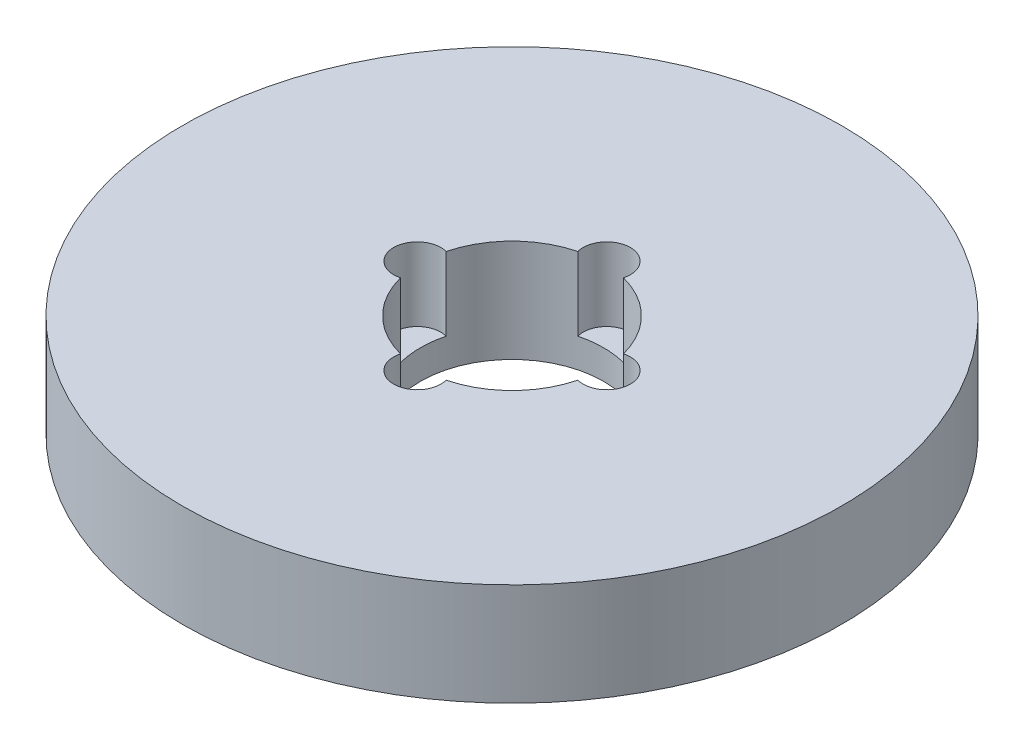
ISO-10303-21;
HEADER;
FILE_DESCRIPTION(('STEP AP214'),'2;1');
FILE_NAME('part.step','',(''),(''),'','','');
FILE_SCHEMA(('AUTOMOTIVE_DESIGN { 1 0 10303 214 1 1 1 1 }'));
ENDSEC;
DATA;
#1=APPLICATION_CONTEXT('core data for automotive mechanical design processes');
#2=APPLICATION_PROTOCOL_DEFINITION('international standard','automotive_design',2000,#1);
#3=PRODUCT_CONTEXT('',#1,'mechanical');
#4=PRODUCT('Part','Part','',(#3));
#5=PRODUCT_RELATED_PRODUCT_CATEGORY('part','',(#4));
#6=PRODUCT_DEFINITION_FORMATION('','',#4);
#7=PRODUCT_DEFINITION_CONTEXT('part definition',#1,'design');
#8=PRODUCT_DEFINITION('design','',#6,#7);
#9=PRODUCT_DEFINITION_SHAPE('','',#8);
#10=(LENGTH_UNIT() NAMED_UNIT(*) SI_UNIT(.MILLI.,.METRE.));
#11=(NAMED_UNIT(*) PLANE_ANGLE_UNIT() SI_UNIT($,.RADIAN.));
#12=(NAMED_UNIT(*) SI_UNIT($,.STERADIAN.) SOLID_ANGLE_UNIT());
#13=UNCERTAINTY_MEASURE_WITH_UNIT(LENGTH_MEASURE(1.E-05),#10,'distance_accuracy_value','');
#14=(GEOMETRIC_REPRESENTATION_CONTEXT(3) GLOBAL_UNCERTAINTY_ASSIGNED_CONTEXT((#13)) GLOBAL_UNIT_ASSIGNED_CONTEXT((#10,
#11,#12)) REPRESENTATION_CONTEXT('',''));
#15=CARTESIAN_POINT('',(0.,0.,0.));
#16=DIRECTION('',(0.,0.,1.));
#17=DIRECTION('',(1.,0.,0.));
#18=AXIS2_PLACEMENT_3D('',#15,#16,#17);
#19=CARTESIAN_POINT('',(0.,14.,0.));
#20=DIRECTION('',(0.,-1.,0.));
#21=DIRECTION('',(0.,0.,-1.));
#22=AXIS2_PLACEMENT_3D('',#19,#20,#21);
#23=CYLINDRICAL_SURFACE('',#22,45.);
#24=CARTESIAN_POINT('',(0.,14.,0.));
#25=DIRECTION('',(0.,1.,0.));
#26=DIRECTION('',(0.,0.,1.));
#27=AXIS2_PLACEMENT_3D('',#24,#25,#26);
#28=CIRCLE('',#27,45.);
#29=CARTESIAN_POINT('',(0.,14.,45.));
#30=VERTEX_POINT('',#29);
#31=EDGE_CURVE('E145',#30,#30,#28,.T.);
#32=ORIENTED_EDGE('',*,*,#31,.F.);
#33=EDGE_LOOP('',(#32));
#34=FACE_BOUND('',#33,.T.);
#35=CARTESIAN_POINT('',(0.,0.,0.));
#36=DIRECTION('',(0.,1.,0.));
#37=DIRECTION('',(0.,0.,1.));
#38=AXIS2_PLACEMENT_3D('',#35,#36,#37);
#39=CIRCLE('',#38,45.);
#40=CARTESIAN_POINT('',(0.,0.,45.));
#41=VERTEX_POINT('',#40);
#42=EDGE_CURVE('E143',#41,#41,#39,.T.);
#43=ORIENTED_EDGE('',*,*,#42,.T.);
#44=EDGE_LOOP('',(#43));
#45=FACE_BOUND('',#44,.T.);
#46=ADVANCED_FACE('F39',(#34,#45),#23,.T.);
#47=CARTESIAN_POINT('',(0.,14.,0.));
#48=DIRECTION('',(0.,1.,0.));
#49=DIRECTION('',(0.,0.,1.));
#50=AXIS2_PLACEMENT_3D('',#47,#48,#49);
#51=PLANE('',#50);
#52=CARTESIAN_POINT('',(0.,14.,12.9368694405795));
#53=DIRECTION('',(0.,1.,0.));
#54=DIRECTION('',(1.,0.,0.));
#55=AXIS2_PLACEMENT_3D('',#52,#53,#54);
#56=CIRCLE('',#55,3.22331690164593);
#57=CARTESIAN_POINT('',(-3.11434234712611,14.,12.1058197469191));
#58=VERTEX_POINT('',#57);
#59=CARTESIAN_POINT('',(3.11434234712619,14.,12.1058197469191));
#60=VERTEX_POINT('',#59);
#61=EDGE_CURVE('E152',#58,#60,#56,.T.);
#62=ORIENTED_EDGE('',*,*,#61,.F.);
#63=CARTESIAN_POINT('',(0.,14.,0.));
#64=DIRECTION('',(0.,1.,0.));
#65=DIRECTION('',(0.,0.,1.));
#66=AXIS2_PLACEMENT_3D('',#63,#64,#65);
#67=CIRCLE('',#66,12.5);
#68=CARTESIAN_POINT('',(-12.1058197469191,14.,3.11434234712615));
#69=VERTEX_POINT('',#68);
#70=EDGE_CURVE('E133',#69,#58,#67,.T.);
#71=ORIENTED_EDGE('',*,*,#70,.F.);
#72=CARTESIAN_POINT('',(-12.9368694405795,14.,0.));
#73=DIRECTION('',(0.,1.,0.));
#74=DIRECTION('',(0.,0.,1.));
#75=AXIS2_PLACEMENT_3D('',#72,#73,#74);
#76=CIRCLE('',#75,3.22331690164593);
#77=CARTESIAN_POINT('',(-12.1058197469191,14.,-3.11434234712615));
#78=VERTEX_POINT('',#77);
#79=EDGE_CURVE('E128',#78,#69,#76,.T.);
#80=ORIENTED_EDGE('',*,*,#79,.F.);
#81=CARTESIAN_POINT('',(-3.11434234712627,14.,-12.1058197469191));
#82=VERTEX_POINT('',#81);
#83=EDGE_CURVE('E121',#82,#78,#67,.T.);
#84=ORIENTED_EDGE('',*,*,#83,.F.);
#85=CARTESIAN_POINT('',(-1.355065147045E-13,14.,-12.9368694405795));
#86=DIRECTION('',(0.,1.,0.));
#87=DIRECTION('',(-1.,0.,0.));
#88=AXIS2_PLACEMENT_3D('',#85,#86,#87);
#89=CIRCLE('',#88,3.22331690164593);
#90=CARTESIAN_POINT('',(3.11434234712602,14.,-12.1058197469192));
#91=VERTEX_POINT('',#90);
#92=EDGE_CURVE('E105',#91,#82,#89,.T.);
#93=ORIENTED_EDGE('',*,*,#92,.F.);
#94=CARTESIAN_POINT('',(12.1058197469191,14.,-3.11434234712615));
#95=VERTEX_POINT('',#94);
#96=EDGE_CURVE('E131',#95,#91,#67,.T.);
#97=ORIENTED_EDGE('',*,*,#96,.F.);
#98=CARTESIAN_POINT('',(12.9368694405795,14.,0.));
#99=DIRECTION('',(0.,1.,0.));
#100=DIRECTION('',(0.,0.,-1.));
#101=AXIS2_PLACEMENT_3D('',#98,#99,#100);
#102=CIRCLE('',#101,3.22331690164593);
#103=CARTESIAN_POINT('',(12.1058197469191,14.,3.11434234712615));
#104=VERTEX_POINT('',#103);
#105=EDGE_CURVE('E154',#104,#95,#102,.T.);
#106=ORIENTED_EDGE('',*,*,#105,.F.);
#107=EDGE_CURVE('E134',#60,#104,#67,.T.);
#108=ORIENTED_EDGE('',*,*,#107,.F.);
#109=EDGE_LOOP('',(#62,#71,#80,#84,#93,#97,#106,#108));
#110=FACE_BOUND('',#109,.T.);
#111=ORIENTED_EDGE('',*,*,#31,.T.);
#112=EDGE_LOOP('',(#111));
#113=FACE_BOUND('',#112,.T.);
#114=ADVANCED_FACE('F130',(#110,#113),#51,.T.);
#115=CARTESIAN_POINT('',(0.,0.,0.));
#116=DIRECTION('',(0.,1.,0.));
#117=DIRECTION('',(0.,0.,1.));
#118=AXIS2_PLACEMENT_3D('',#115,#116,#117);
#119=PLANE('',#118);
#120=CARTESIAN_POINT('',(0.,0.,0.));
#121=DIRECTION('',(0.,1.,0.));
#122=DIRECTION('',(0.,0.,1.));
#123=AXIS2_PLACEMENT_3D('',#120,#121,#122);
#124=CIRCLE('',#123,12.5);
#125=CARTESIAN_POINT('',(0.,0.,12.5));
#126=VERTEX_POINT('',#125);
#127=EDGE_CURVE('E135',#126,#126,#124,.T.);
#128=ORIENTED_EDGE('',*,*,#127,.T.);
#129=EDGE_LOOP('',(#128));
#130=FACE_BOUND('',#129,.T.);
#131=ORIENTED_EDGE('',*,*,#42,.F.);
#132=EDGE_LOOP('',(#131));
#133=FACE_BOUND('',#132,.T.);
#134=ADVANCED_FACE('F195',(#130,#133),#119,.F.);
#135=CARTESIAN_POINT('',(0.,14.,0.));
#136=DIRECTION('',(0.,-1.,0.));
#137=DIRECTION('',(0.,0.,-1.));
#138=AXIS2_PLACEMENT_3D('',#135,#136,#137);
#139=CYLINDRICAL_SURFACE('',#138,12.5);
#140=DIRECTION('',(0.,1.,0.));
#141=VECTOR('',#140,1.);
#142=CARTESIAN_POINT('',(-3.11434234712611,8.99186282411448,12.1058197469191));
#143=LINE('',#142,#141);
#144=CARTESIAN_POINT('',(-3.11434234712611,3.98372564822896,12.1058197469191));
#145=VERTEX_POINT('',#144);
#146=EDGE_CURVE('E11',#145,#58,#143,.T.);
#147=ORIENTED_EDGE('',*,*,#146,.F.);
#148=CARTESIAN_POINT('',(0.,3.98372564822896,0.));
#149=DIRECTION('',(0.,1.,0.));
#150=DIRECTION('',(0.,0.,1.));
#151=AXIS2_PLACEMENT_3D('',#148,#149,#150);
#152=CIRCLE('',#151,12.5);
#153=CARTESIAN_POINT('',(3.11434234712619,3.98372564822896,12.1058197469191));
#154=VERTEX_POINT('',#153);
#155=EDGE_CURVE('E169',#145,#154,#152,.T.);
#156=ORIENTED_EDGE('',*,*,#155,.T.);
#157=DIRECTION('',(0.,1.,0.));
#158=VECTOR('',#157,1.);
#159=CARTESIAN_POINT('',(3.11434234712619,8.99186282411448,12.1058197469191));
#160=LINE('',#159,#158);
#161=EDGE_CURVE('E46',#60,#154,#160,.F.);
#162=ORIENTED_EDGE('',*,*,#161,.F.);
#163=ORIENTED_EDGE('',*,*,#107,.T.);
#164=DIRECTION('',(0.,1.,0.));
#165=VECTOR('',#164,1.);
#166=CARTESIAN_POINT('',(12.1058197469191,8.99186282411448,3.11434234712615));
#167=LINE('',#166,#165);
#168=CARTESIAN_POINT('',(12.1058197469191,3.98372564822896,3.11434234712615));
#169=VERTEX_POINT('',#168);
#170=EDGE_CURVE('E151',#169,#104,#167,.T.);
#171=ORIENTED_EDGE('',*,*,#170,.F.);
#172=CARTESIAN_POINT('',(0.,3.98372564822896,0.));
#173=DIRECTION('',(0.,1.,0.));
#174=DIRECTION('',(0.,0.,1.));
#175=AXIS2_PLACEMENT_3D('',#172,#173,#174);
#176=CIRCLE('',#175,12.5);
#177=CARTESIAN_POINT('',(12.1058197469191,3.98372564822896,-3.11434234712615));
#178=VERTEX_POINT('',#177);
#179=EDGE_CURVE('E173',#169,#178,#176,.T.);
#180=ORIENTED_EDGE('',*,*,#179,.T.);
#181=DIRECTION('',(0.,1.,0.));
#182=VECTOR('',#181,1.);
#183=CARTESIAN_POINT('',(12.1058197469191,8.99186282411448,-3.11434234712615));
#184=LINE('',#183,#182);
#185=EDGE_CURVE('E168',#95,#178,#184,.F.);
#186=ORIENTED_EDGE('',*,*,#185,.F.);
#187=ORIENTED_EDGE('',*,*,#96,.T.);
#188=DIRECTION('',(0.,1.,0.));
#189=VECTOR('',#188,1.);
#190=CARTESIAN_POINT('',(3.11434234712602,8.99186282411448,-12.1058197469191));
#191=LINE('',#190,#189);
#192=CARTESIAN_POINT('',(3.11434234712602,3.98372564822896,-12.1058197469192));
#193=VERTEX_POINT('',#192);
#194=EDGE_CURVE('E108',#193,#91,#191,.T.);
#195=ORIENTED_EDGE('',*,*,#194,.F.);
#196=CARTESIAN_POINT('',(0.,3.98372564822896,0.));
#197=DIRECTION('',(0.,1.,0.));
#198=DIRECTION('',(0.,0.,1.));
#199=AXIS2_PLACEMENT_3D('',#196,#197,#198);
#200=CIRCLE('',#199,12.5);
#201=CARTESIAN_POINT('',(-3.11434234712627,3.98372564822896,-12.1058197469191));
#202=VERTEX_POINT('',#201);
#203=EDGE_CURVE('E122',#193,#202,#200,.T.);
#204=ORIENTED_EDGE('',*,*,#203,.T.);
#205=DIRECTION('',(0.,1.,0.));
#206=VECTOR('',#205,1.);
#207=CARTESIAN_POINT('',(-3.11434234712627,8.99186282411448,-12.1058197469191));
#208=LINE('',#207,#206);
#209=EDGE_CURVE('E106',#82,#202,#208,.F.);
#210=ORIENTED_EDGE('',*,*,#209,.F.);
#211=ORIENTED_EDGE('',*,*,#83,.T.);
#212=DIRECTION('',(0.,1.,0.));
#213=VECTOR('',#212,1.);
#214=CARTESIAN_POINT('',(-12.1058197469191,8.99186282411448,-3.11434234712615));
#215=LINE('',#214,#213);
#216=CARTESIAN_POINT('',(-12.1058197469191,3.98372564822896,-3.11434234712615));
#217=VERTEX_POINT('',#216);
#218=EDGE_CURVE('E177',#217,#78,#215,.T.);
#219=ORIENTED_EDGE('',*,*,#218,.F.);
#220=CARTESIAN_POINT('',(0.,3.98372564822896,0.));
#221=DIRECTION('',(0.,1.,0.));
#222=DIRECTION('',(0.,0.,1.));
#223=AXIS2_PLACEMENT_3D('',#220,#221,#222);
#224=CIRCLE('',#223,12.5);
#225=CARTESIAN_POINT('',(-12.1058197469191,3.98372564822896,3.11434234712615));
#226=VERTEX_POINT('',#225);
#227=EDGE_CURVE('E185',#217,#226,#224,.T.);
#228=ORIENTED_EDGE('',*,*,#227,.T.);
#229=DIRECTION('',(0.,1.,0.));
#230=VECTOR('',#229,1.);
#231=CARTESIAN_POINT('',(-12.1058197469191,8.99186282411448,3.11434234712615));
#232=LINE('',#231,#230);
#233=EDGE_CURVE('E179',#69,#226,#232,.F.);
#234=ORIENTED_EDGE('',*,*,#233,.F.);
#235=ORIENTED_EDGE('',*,*,#70,.T.);
#236=EDGE_LOOP('',(#147,#156,#162,#163,#171,#180,#186,#187,#195,#204,#210,#211,#219,#228,#234,#235));
#237=FACE_BOUND('',#236,.T.);
#238=ORIENTED_EDGE('',*,*,#127,.F.);
#239=EDGE_LOOP('',(#238));
#240=FACE_BOUND('',#239,.T.);
#241=ADVANCED_FACE('F117',(#237,#240),#139,.F.);
#242=CARTESIAN_POINT('',(-12.9368694405795,3.98372564822896,0.));
#243=DIRECTION('',(0.,1.,0.));
#244=DIRECTION('',(0.,0.,1.));
#245=AXIS2_PLACEMENT_3D('',#242,#243,#244);
#246=CYLINDRICAL_SURFACE('',#245,3.22331690164593);
#247=ORIENTED_EDGE('',*,*,#218,.T.);
#248=ORIENTED_EDGE('',*,*,#79,.T.);
#249=ORIENTED_EDGE('',*,*,#233,.T.);
#250=CARTESIAN_POINT('',(-12.9368694405795,3.98372564822896,0.));
#251=DIRECTION('',(0.,1.,0.));
#252=DIRECTION('',(0.,0.,1.));
#253=AXIS2_PLACEMENT_3D('',#250,#251,#252);
#254=CIRCLE('',#253,3.22331690164593);
#255=EDGE_CURVE('E140',#217,#226,#254,.T.);
#256=ORIENTED_EDGE('',*,*,#255,.F.);
#257=EDGE_LOOP('',(#247,#248,#249,#256));
#258=FACE_BOUND('',#257,.T.);
#259=ADVANCED_FACE('F200',(#258),#246,.F.);
#260=CARTESIAN_POINT('',(-12.9368694405795,3.98372564822896,0.));
#261=DIRECTION('',(0.,1.,0.));
#262=DIRECTION('',(0.,0.,1.));
#263=AXIS2_PLACEMENT_3D('',#260,#261,#262);
#264=PLANE('',#263);
#265=ORIENTED_EDGE('',*,*,#255,.T.);
#266=ORIENTED_EDGE('',*,*,#227,.F.);
#267=EDGE_LOOP('',(#265,#266));
#268=FACE_BOUND('',#267,.T.);
#269=ADVANCED_FACE('F202',(#268),#264,.T.);
#270=CARTESIAN_POINT('',(-1.355065147045E-13,3.98372564822896,-12.9368694405795));
#271=DIRECTION('',(0.,1.,0.));
#272=DIRECTION('',(0.,0.,1.));
#273=AXIS2_PLACEMENT_3D('',#270,#271,#272);
#274=CYLINDRICAL_SURFACE('',#273,3.22331690164593);
#275=ORIENTED_EDGE('',*,*,#194,.T.);
#276=ORIENTED_EDGE('',*,*,#92,.T.);
#277=ORIENTED_EDGE('',*,*,#209,.T.);
#278=CARTESIAN_POINT('',(-1.355065147045E-13,3.98372564822896,-12.9368694405795));
#279=DIRECTION('',(0.,1.,0.));
#280=DIRECTION('',(-1.,0.,0.));
#281=AXIS2_PLACEMENT_3D('',#278,#279,#280);
#282=CIRCLE('',#281,3.22331690164593);
#283=EDGE_CURVE('E111',#193,#202,#282,.T.);
#284=ORIENTED_EDGE('',*,*,#283,.F.);
#285=EDGE_LOOP('',(#275,#276,#277,#284));
#286=FACE_BOUND('',#285,.T.);
#287=ADVANCED_FACE('F102',(#286),#274,.F.);
#288=CARTESIAN_POINT('',(-1.355065147045E-13,3.98372564822896,-12.9368694405795));
#289=DIRECTION('',(0.,1.,0.));
#290=DIRECTION('',(-1.,0.,0.));
#291=AXIS2_PLACEMENT_3D('',#288,#289,#290);
#292=PLANE('',#291);
#293=ORIENTED_EDGE('',*,*,#283,.T.);
#294=ORIENTED_EDGE('',*,*,#203,.F.);
#295=EDGE_LOOP('',(#293,#294));
#296=FACE_BOUND('',#295,.T.);
#297=ADVANCED_FACE('F211',(#296),#292,.T.);
#298=CARTESIAN_POINT('',(12.9368694405795,3.98372564822896,0.));
#299=DIRECTION('',(0.,1.,0.));
#300=DIRECTION('',(0.,0.,1.));
#301=AXIS2_PLACEMENT_3D('',#298,#299,#300);
#302=CYLINDRICAL_SURFACE('',#301,3.22331690164593);
#303=ORIENTED_EDGE('',*,*,#170,.T.);
#304=ORIENTED_EDGE('',*,*,#105,.T.);
#305=ORIENTED_EDGE('',*,*,#185,.T.);
#306=CARTESIAN_POINT('',(12.9368694405795,3.98372564822896,0.));
#307=DIRECTION('',(0.,1.,0.));
#308=DIRECTION('',(0.,0.,-1.));
#309=AXIS2_PLACEMENT_3D('',#306,#307,#308);
#310=CIRCLE('',#309,3.22331690164593);
#311=EDGE_CURVE('E56',#169,#178,#310,.T.);
#312=ORIENTED_EDGE('',*,*,#311,.F.);
#313=EDGE_LOOP('',(#303,#304,#305,#312));
#314=FACE_BOUND('',#313,.T.);
#315=ADVANCED_FACE('F212',(#314),#302,.F.);
#316=CARTESIAN_POINT('',(12.9368694405795,3.98372564822896,0.));
#317=DIRECTION('',(0.,1.,0.));
#318=DIRECTION('',(0.,0.,-1.));
#319=AXIS2_PLACEMENT_3D('',#316,#317,#318);
#320=PLANE('',#319);
#321=ORIENTED_EDGE('',*,*,#311,.T.);
#322=ORIENTED_EDGE('',*,*,#179,.F.);
#323=EDGE_LOOP('',(#321,#322));
#324=FACE_BOUND('',#323,.T.);
#325=ADVANCED_FACE('F217',(#324),#320,.T.);
#326=CARTESIAN_POINT('',(0.,3.98372564822896,12.9368694405795));
#327=DIRECTION('',(0.,1.,0.));
#328=DIRECTION('',(0.,0.,1.));
#329=AXIS2_PLACEMENT_3D('',#326,#327,#328);
#330=CYLINDRICAL_SURFACE('',#329,3.22331690164593);
#331=ORIENTED_EDGE('',*,*,#146,.T.);
#332=ORIENTED_EDGE('',*,*,#61,.T.);
#333=ORIENTED_EDGE('',*,*,#161,.T.);
#334=CARTESIAN_POINT('',(0.,3.98372564822896,12.9368694405795));
#335=DIRECTION('',(0.,1.,0.));
#336=DIRECTION('',(1.,0.,0.));
#337=AXIS2_PLACEMENT_3D('',#334,#335,#336);
#338=CIRCLE('',#337,3.22331690164593);
#339=EDGE_CURVE('E55',#145,#154,#338,.T.);
#340=ORIENTED_EDGE('',*,*,#339,.F.);
#341=EDGE_LOOP('',(#331,#332,#333,#340));
#342=FACE_BOUND('',#341,.T.);
#343=ADVANCED_FACE('F170',(#342),#330,.F.);
#344=CARTESIAN_POINT('',(0.,3.98372564822896,12.9368694405795));
#345=DIRECTION('',(0.,1.,0.));
#346=DIRECTION('',(1.,0.,0.));
#347=AXIS2_PLACEMENT_3D('',#344,#345,#346);
#348=PLANE('',#347);
#349=ORIENTED_EDGE('',*,*,#339,.T.);
#350=ORIENTED_EDGE('',*,*,#155,.F.);
#351=EDGE_LOOP('',(#349,#350));
#352=FACE_BOUND('',#351,.T.);
#353=ADVANCED_FACE('F224',(#352),#348,.T.);
#354=CLOSED_SHELL('',(#46,#114,#134,#241,#259,#269,#287,#297,#315,#325,#343,#353));
#355=MANIFOLD_SOLID_BREP('B2',#354);
#356=ADVANCED_BREP_SHAPE_REPRESENTATION('',(#18,#355),#14);
#357=SHAPE_DEFINITION_REPRESENTATION(#9,#356);
ENDSEC;
END-ISO-10303-21;
